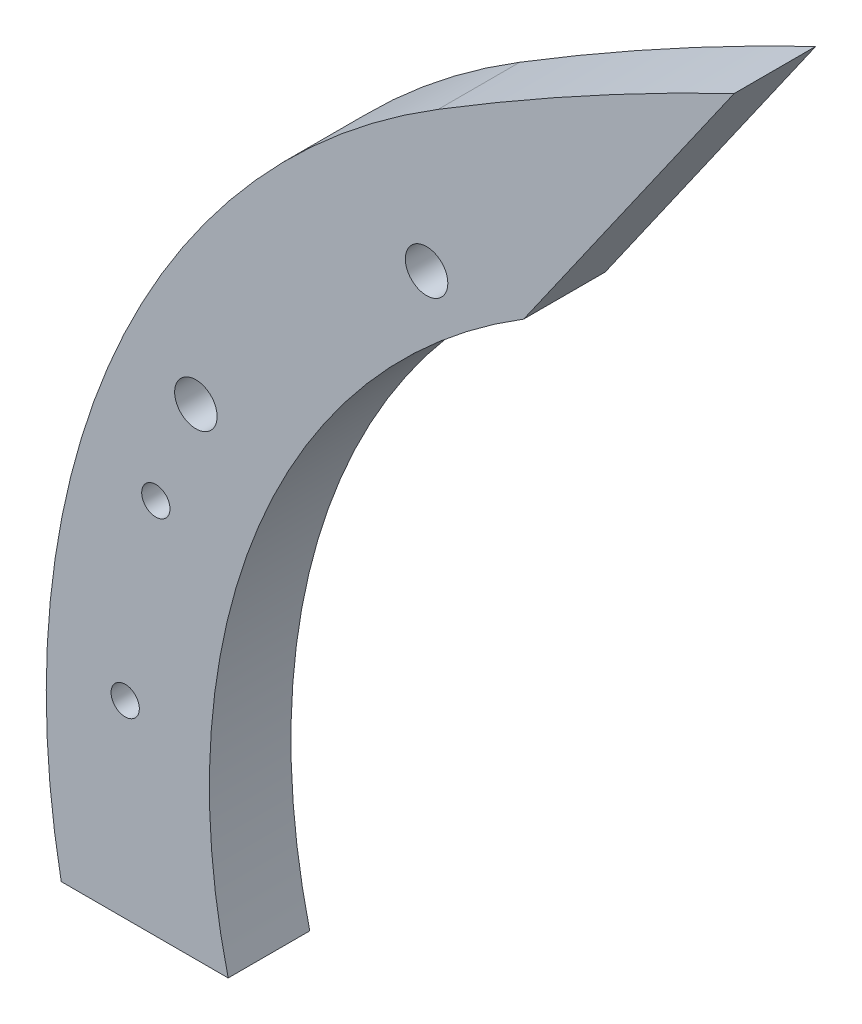
ISO-10303-21;
HEADER;
FILE_DESCRIPTION(('STEP AP214'),'2;1');
FILE_NAME('part.step','',(''),(''),'','','');
FILE_SCHEMA(('AUTOMOTIVE_DESIGN { 1 0 10303 214 1 1 1 1 }'));
ENDSEC;
DATA;
#1=APPLICATION_CONTEXT('core data for automotive mechanical design processes');
#2=APPLICATION_PROTOCOL_DEFINITION('international standard','automotive_design',2000,#1);
#3=PRODUCT_CONTEXT('',#1,'mechanical');
#4=PRODUCT('Part','Part','',(#3));
#5=PRODUCT_RELATED_PRODUCT_CATEGORY('part','',(#4));
#6=PRODUCT_DEFINITION_FORMATION('','',#4);
#7=PRODUCT_DEFINITION_CONTEXT('part definition',#1,'design');
#8=PRODUCT_DEFINITION('design','',#6,#7);
#9=PRODUCT_DEFINITION_SHAPE('','',#8);
#10=(LENGTH_UNIT() NAMED_UNIT(*) SI_UNIT(.MILLI.,.METRE.));
#11=(NAMED_UNIT(*) PLANE_ANGLE_UNIT() SI_UNIT($,.RADIAN.));
#12=(NAMED_UNIT(*) SI_UNIT($,.STERADIAN.) SOLID_ANGLE_UNIT());
#13=UNCERTAINTY_MEASURE_WITH_UNIT(LENGTH_MEASURE(1.E-05),#10,'distance_accuracy_value','');
#14=(GEOMETRIC_REPRESENTATION_CONTEXT(3) GLOBAL_UNCERTAINTY_ASSIGNED_CONTEXT((#13)) GLOBAL_UNIT_ASSIGNED_CONTEXT((#10,
#11,#12)) REPRESENTATION_CONTEXT('',''));
#15=CARTESIAN_POINT('',(0.,0.,0.));
#16=DIRECTION('',(0.,0.,1.));
#17=DIRECTION('',(1.,0.,0.));
#18=AXIS2_PLACEMENT_3D('',#15,#16,#17);
#19=CARTESIAN_POINT('',(0.,0.,9.525));
#20=DIRECTION('',(0.,0.,-1.));
#21=DIRECTION('',(-1.,0.,0.));
#22=AXIS2_PLACEMENT_3D('',#19,#20,#21);
#23=CYLINDRICAL_SURFACE('',#22,154.059652570481);
#24=CARTESIAN_POINT('',(0.,0.,-9.525));
#25=DIRECTION('',(0.,0.,-1.));
#26=DIRECTION('',(1.,0.,0.));
#27=AXIS2_PLACEMENT_3D('',#24,#25,#26);
#28=CIRCLE('',#27,154.059652570481);
#29=CARTESIAN_POINT('',(-149.670350750867,-36.5125,-9.525));
#30=VERTEX_POINT('',#29);
#31=CARTESIAN_POINT('',(-80.6588682738073,131.257470335696,-9.525));
#32=VERTEX_POINT('',#31);
#33=EDGE_CURVE('E117',#30,#32,#28,.T.);
#34=ORIENTED_EDGE('',*,*,#33,.T.);
#35=DIRECTION('',(0.,0.,-1.));
#36=VECTOR('',#35,1.);
#37=CARTESIAN_POINT('',(-80.6588682738073,131.257470335696,9.525));
#38=LINE('',#37,#36);
#39=CARTESIAN_POINT('',(-80.6588682738073,131.257470335696,9.525));
#40=VERTEX_POINT('',#39);
#41=EDGE_CURVE('E11',#40,#32,#38,.T.);
#42=ORIENTED_EDGE('',*,*,#41,.F.);
#43=CARTESIAN_POINT('',(0.,0.,9.525));
#44=DIRECTION('',(0.,0.,-1.));
#45=DIRECTION('',(1.,0.,0.));
#46=AXIS2_PLACEMENT_3D('',#43,#44,#45);
#47=CIRCLE('',#46,154.059652570481);
#48=CARTESIAN_POINT('',(-149.670350750867,-36.5125,9.525));
#49=VERTEX_POINT('',#48);
#50=EDGE_CURVE('E130',#49,#40,#47,.T.);
#51=ORIENTED_EDGE('',*,*,#50,.F.);
#52=DIRECTION('',(0.,0.,-1.));
#53=VECTOR('',#52,1.);
#54=CARTESIAN_POINT('',(-149.670350750867,-36.5125,9.525));
#55=LINE('',#54,#53);
#56=EDGE_CURVE('E113',#49,#30,#55,.T.);
#57=ORIENTED_EDGE('',*,*,#56,.T.);
#58=EDGE_LOOP('',(#34,#42,#51,#57));
#59=FACE_BOUND('',#58,.T.);
#60=ADVANCED_FACE('F37',(#59),#23,.F.);
#61=CARTESIAN_POINT('',(-80.6588682738073,131.257470335696,9.525));
#62=DIRECTION('',(-0.819152044288993,0.573576436351044,0.));
#63=DIRECTION('',(-0.573576436351044,-0.819152044288993,0.));
#64=AXIS2_PLACEMENT_3D('',#61,#62,#63);
#65=PLANE('',#64);
#66=DIRECTION('',(0.573576436351044,0.819152044288993,0.));
#67=VECTOR('',#66,1.);
#68=CARTESIAN_POINT('',(-80.6588682738073,131.257470335696,-9.525));
#69=LINE('',#68,#67);
#70=CARTESIAN_POINT('',(-31.489028267614,201.47927933237,-9.525));
#71=VERTEX_POINT('',#70);
#72=EDGE_CURVE('E121',#32,#71,#69,.T.);
#73=ORIENTED_EDGE('',*,*,#72,.T.);
#74=DIRECTION('',(0.,0.,-1.));
#75=VECTOR('',#74,1.);
#76=CARTESIAN_POINT('',(-31.489028267614,201.47927933237,9.525));
#77=LINE('',#76,#75);
#78=CARTESIAN_POINT('',(-31.489028267614,201.47927933237,9.525));
#79=VERTEX_POINT('',#78);
#80=EDGE_CURVE('E46',#79,#71,#77,.T.);
#81=ORIENTED_EDGE('',*,*,#80,.F.);
#82=DIRECTION('',(0.573576436351044,0.819152044288993,0.));
#83=VECTOR('',#82,1.);
#84=CARTESIAN_POINT('',(-80.6588682738073,131.257470335696,9.525));
#85=LINE('',#84,#83);
#86=EDGE_CURVE('E88',#40,#79,#85,.T.);
#87=ORIENTED_EDGE('',*,*,#86,.F.);
#88=ORIENTED_EDGE('',*,*,#41,.T.);
#89=EDGE_LOOP('',(#73,#81,#87,#88));
#90=FACE_BOUND('',#89,.T.);
#91=ADVANCED_FACE('F154',(#90),#65,.F.);
#92=CARTESIAN_POINT('',(303.855106175618,-494.468288964898,9.525));
#93=DIRECTION('',(0.,0.,-1.));
#94=DIRECTION('',(-1.,0.,0.));
#95=AXIS2_PLACEMENT_3D('',#92,#93,#94);
#96=CYLINDRICAL_SURFACE('',#95,772.527479332846);
#97=CARTESIAN_POINT('',(303.855106175618,-494.468288964898,-9.525));
#98=DIRECTION('',(0.,0.,1.));
#99=DIRECTION('',(-1.,0.,0.));
#100=AXIS2_PLACEMENT_3D('',#97,#98,#99);
#101=CIRCLE('',#100,772.527479332846);
#102=CARTESIAN_POINT('',(-100.606355042454,163.718335567766,-9.525));
#103=VERTEX_POINT('',#102);
#104=EDGE_CURVE('E104',#71,#103,#101,.T.);
#105=ORIENTED_EDGE('',*,*,#104,.T.);
#106=DIRECTION('',(0.,0.,-1.));
#107=VECTOR('',#106,1.);
#108=CARTESIAN_POINT('',(-100.606355042454,163.718335567766,9.525));
#109=LINE('',#108,#107);
#110=CARTESIAN_POINT('',(-100.606355042454,163.718335567766,9.525));
#111=VERTEX_POINT('',#110);
#112=EDGE_CURVE('E101',#111,#103,#109,.T.);
#113=ORIENTED_EDGE('',*,*,#112,.F.);
#114=CARTESIAN_POINT('',(303.855106175618,-494.468288964898,9.525));
#115=DIRECTION('',(0.,0.,1.));
#116=DIRECTION('',(-1.,0.,0.));
#117=AXIS2_PLACEMENT_3D('',#114,#115,#116);
#118=CIRCLE('',#117,772.527479332846);
#119=EDGE_CURVE('E92',#79,#111,#118,.T.);
#120=ORIENTED_EDGE('',*,*,#119,.F.);
#121=ORIENTED_EDGE('',*,*,#80,.T.);
#122=EDGE_LOOP('',(#105,#113,#120,#121));
#123=FACE_BOUND('',#122,.T.);
#124=ADVANCED_FACE('F102',(#123),#96,.T.);
#125=CARTESIAN_POINT('',(0.,0.,9.525));
#126=DIRECTION('',(0.,0.,-1.));
#127=DIRECTION('',(-1.,0.,0.));
#128=AXIS2_PLACEMENT_3D('',#125,#126,#127);
#129=CYLINDRICAL_SURFACE('',#128,192.159652570481);
#130=CARTESIAN_POINT('',(0.,0.,-9.525));
#131=DIRECTION('',(0.,0.,1.));
#132=DIRECTION('',(1.,0.,0.));
#133=AXIS2_PLACEMENT_3D('',#130,#131,#132);
#134=CIRCLE('',#133,192.159652570481);
#135=CARTESIAN_POINT('',(-188.65887050377,-36.5125,-9.525));
#136=VERTEX_POINT('',#135);
#137=EDGE_CURVE('E74',#103,#136,#134,.T.);
#138=ORIENTED_EDGE('',*,*,#137,.T.);
#139=DIRECTION('',(0.,0.,-1.));
#140=VECTOR('',#139,1.);
#141=CARTESIAN_POINT('',(-188.65887050377,-36.5125,9.525));
#142=LINE('',#141,#140);
#143=CARTESIAN_POINT('',(-188.65887050377,-36.5125,9.525));
#144=VERTEX_POINT('',#143);
#145=EDGE_CURVE('E106',#144,#136,#142,.T.);
#146=ORIENTED_EDGE('',*,*,#145,.F.);
#147=CARTESIAN_POINT('',(0.,0.,9.525));
#148=DIRECTION('',(0.,0.,1.));
#149=DIRECTION('',(1.,0.,0.));
#150=AXIS2_PLACEMENT_3D('',#147,#148,#149);
#151=CIRCLE('',#150,192.159652570481);
#152=EDGE_CURVE('E96',#111,#144,#151,.T.);
#153=ORIENTED_EDGE('',*,*,#152,.F.);
#154=ORIENTED_EDGE('',*,*,#112,.T.);
#155=EDGE_LOOP('',(#138,#146,#153,#154));
#156=FACE_BOUND('',#155,.T.);
#157=ADVANCED_FACE('F108',(#156),#129,.T.);
#158=CARTESIAN_POINT('',(-149.670350750867,-36.5125,9.525));
#159=DIRECTION('',(0.,1.,0.));
#160=DIRECTION('',(0.,0.,1.));
#161=AXIS2_PLACEMENT_3D('',#158,#159,#160);
#162=PLANE('',#161);
#163=DIRECTION('',(1.,0.,0.));
#164=VECTOR('',#163,1.);
#165=CARTESIAN_POINT('',(-149.670350750867,-36.5125,-9.525));
#166=LINE('',#165,#164);
#167=EDGE_CURVE('E80',#136,#30,#166,.T.);
#168=ORIENTED_EDGE('',*,*,#167,.T.);
#169=ORIENTED_EDGE('',*,*,#56,.F.);
#170=DIRECTION('',(1.,0.,0.));
#171=VECTOR('',#170,1.);
#172=CARTESIAN_POINT('',(-149.670350750867,-36.5125,9.525));
#173=LINE('',#172,#171);
#174=EDGE_CURVE('E54',#144,#49,#173,.T.);
#175=ORIENTED_EDGE('',*,*,#174,.F.);
#176=ORIENTED_EDGE('',*,*,#145,.T.);
#177=EDGE_LOOP('',(#168,#169,#175,#176));
#178=FACE_BOUND('',#177,.T.);
#179=ADVANCED_FACE('F142',(#178),#162,.F.);
#180=CARTESIAN_POINT('',(0.,0.,9.525));
#181=DIRECTION('',(0.,0.,1.));
#182=DIRECTION('',(1.,0.,0.));
#183=AXIS2_PLACEMENT_3D('',#180,#181,#182);
#184=PLANE('',#183);
#185=CARTESIAN_POINT('',(-103.331077236167,129.637230363816,9.525));
#186=DIRECTION('',(0.,0.,1.));
#187=DIRECTION('',(1.,0.,0.));
#188=AXIS2_PLACEMENT_3D('',#185,#186,#187);
#189=CIRCLE('',#188,4.96100099999999);
#190=CARTESIAN_POINT('',(-98.3700762361666,129.637230363816,9.525));
#191=VERTEX_POINT('',#190);
#192=EDGE_CURVE('E233',#191,#191,#189,.T.);
#193=ORIENTED_EDGE('',*,*,#192,.F.);
#194=EDGE_LOOP('',(#193));
#195=FACE_BOUND('',#194,.T.);
#196=CARTESIAN_POINT('',(-157.212613962581,75.7556936374005,9.525));
#197=DIRECTION('',(0.,0.,1.));
#198=DIRECTION('',(1.,0.,0.));
#199=AXIS2_PLACEMENT_3D('',#196,#197,#198);
#200=CIRCLE('',#199,4.96100099999999);
#201=CARTESIAN_POINT('',(-152.251612962581,75.7556936374005,9.525));
#202=VERTEX_POINT('',#201);
#203=EDGE_CURVE('E235',#202,#202,#200,.T.);
#204=ORIENTED_EDGE('',*,*,#203,.F.);
#205=EDGE_LOOP('',(#204));
#206=FACE_BOUND('',#205,.T.);
#207=CARTESIAN_POINT('',(-166.564839950697,51.5692884065631,9.525));
#208=DIRECTION('',(0.,0.,1.));
#209=DIRECTION('',(1.,0.,0.));
#210=AXIS2_PLACEMENT_3D('',#207,#208,#209);
#211=CIRCLE('',#210,3.30200000000013);
#212=CARTESIAN_POINT('',(-163.262839950697,51.5692884065631,9.525));
#213=VERTEX_POINT('',#212);
#214=EDGE_CURVE('E243',#213,#213,#211,.T.);
#215=ORIENTED_EDGE('',*,*,#214,.F.);
#216=EDGE_LOOP('',(#215));
#217=FACE_BOUND('',#216,.T.);
#218=CARTESIAN_POINT('',(-173.718655591782,7.57955745237718,9.525));
#219=DIRECTION('',(0.,0.,1.));
#220=DIRECTION('',(1.,0.,0.));
#221=AXIS2_PLACEMENT_3D('',#218,#219,#220);
#222=CIRCLE('',#221,3.30199999999998);
#223=CARTESIAN_POINT('',(-170.416655591782,7.57955745237718,9.525));
#224=VERTEX_POINT('',#223);
#225=EDGE_CURVE('E251',#224,#224,#222,.T.);
#226=ORIENTED_EDGE('',*,*,#225,.F.);
#227=EDGE_LOOP('',(#226));
#228=FACE_BOUND('',#227,.T.);
#229=ORIENTED_EDGE('',*,*,#50,.T.);
#230=ORIENTED_EDGE('',*,*,#86,.T.);
#231=ORIENTED_EDGE('',*,*,#119,.T.);
#232=ORIENTED_EDGE('',*,*,#152,.T.);
#233=ORIENTED_EDGE('',*,*,#174,.T.);
#234=EDGE_LOOP('',(#229,#230,#231,#232,#233));
#235=FACE_BOUND('',#234,.T.);
#236=ADVANCED_FACE('F94',(#195,#206,#217,#228,#235),#184,.T.);
#237=CARTESIAN_POINT('',(0.,0.,-9.525));
#238=DIRECTION('',(0.,0.,1.));
#239=DIRECTION('',(1.,0.,0.));
#240=AXIS2_PLACEMENT_3D('',#237,#238,#239);
#241=PLANE('',#240);
#242=CARTESIAN_POINT('',(-103.331077236167,129.637230363816,-9.525));
#243=DIRECTION('',(0.,0.,1.));
#244=DIRECTION('',(1.,0.,0.));
#245=AXIS2_PLACEMENT_3D('',#242,#243,#244);
#246=CIRCLE('',#245,4.96100099999999);
#247=CARTESIAN_POINT('',(-98.3700762361666,129.637230363816,-9.525));
#248=VERTEX_POINT('',#247);
#249=EDGE_CURVE('E230',#248,#248,#246,.T.);
#250=ORIENTED_EDGE('',*,*,#249,.T.);
#251=EDGE_LOOP('',(#250));
#252=FACE_BOUND('',#251,.T.);
#253=CARTESIAN_POINT('',(-157.212613962581,75.7556936374005,-9.525));
#254=DIRECTION('',(0.,0.,1.));
#255=DIRECTION('',(1.,0.,0.));
#256=AXIS2_PLACEMENT_3D('',#253,#254,#255);
#257=CIRCLE('',#256,4.96100099999999);
#258=CARTESIAN_POINT('',(-152.251612962581,75.7556936374005,-9.525));
#259=VERTEX_POINT('',#258);
#260=EDGE_CURVE('E240',#259,#259,#257,.T.);
#261=ORIENTED_EDGE('',*,*,#260,.T.);
#262=EDGE_LOOP('',(#261));
#263=FACE_BOUND('',#262,.T.);
#264=CARTESIAN_POINT('',(-166.564839950697,51.5692884065631,-9.525));
#265=DIRECTION('',(0.,0.,1.));
#266=DIRECTION('',(1.,0.,0.));
#267=AXIS2_PLACEMENT_3D('',#264,#265,#266);
#268=CIRCLE('',#267,3.30200000000013);
#269=CARTESIAN_POINT('',(-163.262839950697,51.5692884065631,-9.525));
#270=VERTEX_POINT('',#269);
#271=EDGE_CURVE('E247',#270,#270,#268,.F.);
#272=ORIENTED_EDGE('',*,*,#271,.F.);
#273=EDGE_LOOP('',(#272));
#274=FACE_BOUND('',#273,.T.);
#275=CARTESIAN_POINT('',(-173.718655591782,7.57955745237718,-9.525));
#276=DIRECTION('',(0.,0.,1.));
#277=DIRECTION('',(1.,0.,0.));
#278=AXIS2_PLACEMENT_3D('',#275,#276,#277);
#279=CIRCLE('',#278,3.30199999999998);
#280=CARTESIAN_POINT('',(-170.416655591782,7.57955745237718,-9.525));
#281=VERTEX_POINT('',#280);
#282=EDGE_CURVE('E122',#281,#281,#279,.F.);
#283=ORIENTED_EDGE('',*,*,#282,.F.);
#284=EDGE_LOOP('',(#283));
#285=FACE_BOUND('',#284,.T.);
#286=ORIENTED_EDGE('',*,*,#33,.F.);
#287=ORIENTED_EDGE('',*,*,#167,.F.);
#288=ORIENTED_EDGE('',*,*,#137,.F.);
#289=ORIENTED_EDGE('',*,*,#104,.F.);
#290=ORIENTED_EDGE('',*,*,#72,.F.);
#291=EDGE_LOOP('',(#286,#287,#288,#289,#290));
#292=FACE_BOUND('',#291,.T.);
#293=ADVANCED_FACE('F138',(#252,#263,#274,#285,#292),#241,.F.);
#294=CARTESIAN_POINT('',(-173.718655591782,7.57955745237718,-18.8644663659123));
#295=DIRECTION('',(0.,0.,1.));
#296=DIRECTION('',(1.,0.,0.));
#297=AXIS2_PLACEMENT_3D('',#294,#295,#296);
#298=CYLINDRICAL_SURFACE('',#297,3.30199999999998);
#299=ORIENTED_EDGE('',*,*,#282,.T.);
#300=EDGE_LOOP('',(#299));
#301=FACE_BOUND('',#300,.T.);
#302=ORIENTED_EDGE('',*,*,#225,.T.);
#303=EDGE_LOOP('',(#302));
#304=FACE_BOUND('',#303,.T.);
#305=ADVANCED_FACE('F184',(#301,#304),#298,.F.);
#306=CARTESIAN_POINT('',(-166.564839950697,51.5692884065631,-18.8644663659123));
#307=DIRECTION('',(0.,0.,1.));
#308=DIRECTION('',(1.,0.,0.));
#309=AXIS2_PLACEMENT_3D('',#306,#307,#308);
#310=CYLINDRICAL_SURFACE('',#309,3.30200000000013);
#311=ORIENTED_EDGE('',*,*,#271,.T.);
#312=EDGE_LOOP('',(#311));
#313=FACE_BOUND('',#312,.T.);
#314=ORIENTED_EDGE('',*,*,#214,.T.);
#315=EDGE_LOOP('',(#314));
#316=FACE_BOUND('',#315,.T.);
#317=ADVANCED_FACE('F192',(#313,#316),#310,.F.);
#318=CARTESIAN_POINT('',(-157.212613962581,75.7556936374005,9.525));
#319=DIRECTION('',(0.,0.,1.));
#320=DIRECTION('',(1.,0.,0.));
#321=AXIS2_PLACEMENT_3D('',#318,#319,#320);
#322=CYLINDRICAL_SURFACE('',#321,4.96100099999999);
#323=ORIENTED_EDGE('',*,*,#260,.F.);
#324=EDGE_LOOP('',(#323));
#325=FACE_BOUND('',#324,.T.);
#326=ORIENTED_EDGE('',*,*,#203,.T.);
#327=EDGE_LOOP('',(#326));
#328=FACE_BOUND('',#327,.T.);
#329=ADVANCED_FACE('F200',(#325,#328),#322,.F.);
#330=CARTESIAN_POINT('',(-103.331077236167,129.637230363816,9.525));
#331=DIRECTION('',(0.,0.,1.));
#332=DIRECTION('',(1.,0.,0.));
#333=AXIS2_PLACEMENT_3D('',#330,#331,#332);
#334=CYLINDRICAL_SURFACE('',#333,4.96100099999999);
#335=ORIENTED_EDGE('',*,*,#249,.F.);
#336=EDGE_LOOP('',(#335));
#337=FACE_BOUND('',#336,.T.);
#338=ORIENTED_EDGE('',*,*,#192,.T.);
#339=EDGE_LOOP('',(#338));
#340=FACE_BOUND('',#339,.T.);
#341=ADVANCED_FACE('F208',(#337,#340),#334,.F.);
#342=CLOSED_SHELL('',(#60,#91,#124,#157,#179,#236,#293,#305,#317,#329,#341));
#343=MANIFOLD_SOLID_BREP('B2',#342);
#344=ADVANCED_BREP_SHAPE_REPRESENTATION('',(#18,#343),#14);
#345=SHAPE_DEFINITION_REPRESENTATION(#9,#344);
ENDSEC;
END-ISO-10303-21;
